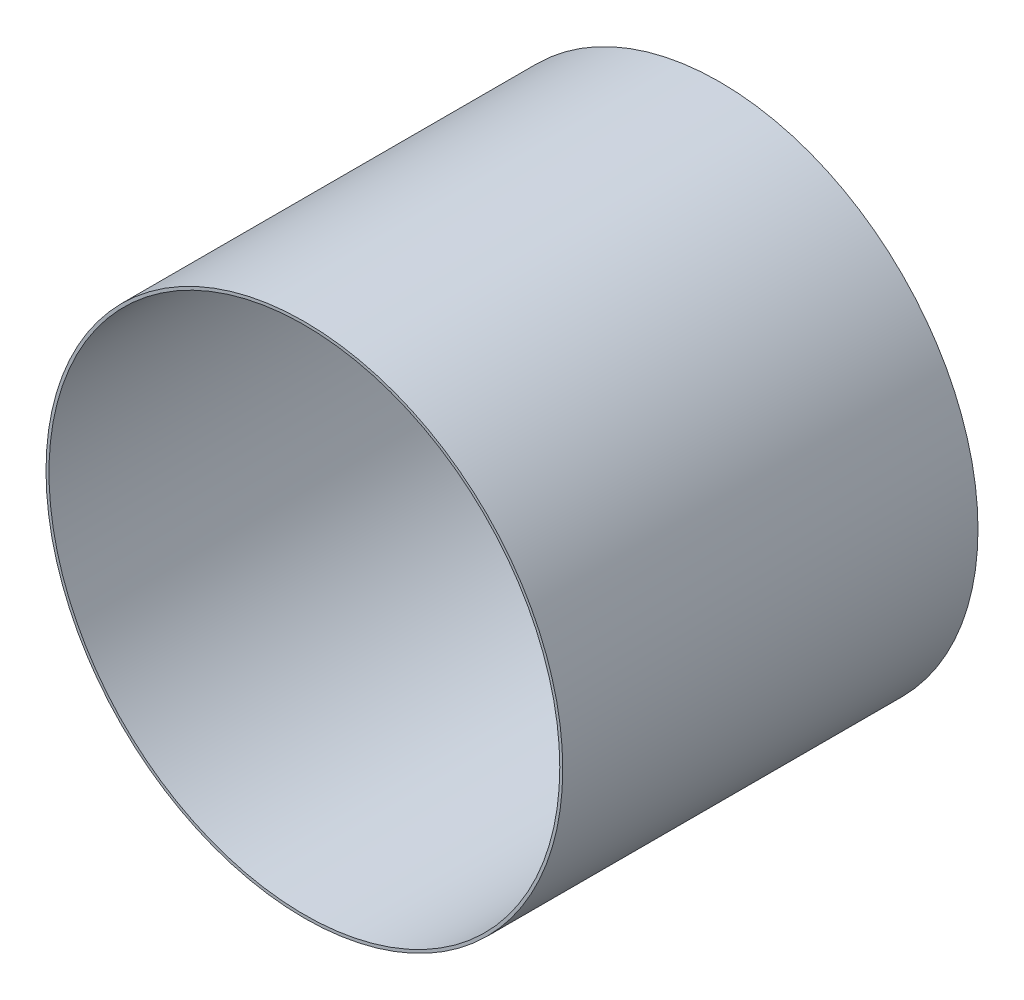
ISO-10303-21;
HEADER;
FILE_DESCRIPTION(('STEP AP214'),'2;1');
FILE_NAME('part.step','',(''),(''),'','','');
FILE_SCHEMA(('AUTOMOTIVE_DESIGN { 1 0 10303 214 1 1 1 1 }'));
ENDSEC;
DATA;
#1=APPLICATION_CONTEXT('core data for automotive mechanical design processes');
#2=APPLICATION_PROTOCOL_DEFINITION('international standard','automotive_design',2000,#1);
#3=PRODUCT_CONTEXT('',#1,'mechanical');
#4=PRODUCT('Part','Part','',(#3));
#5=PRODUCT_RELATED_PRODUCT_CATEGORY('part','',(#4));
#6=PRODUCT_DEFINITION_FORMATION('','',#4);
#7=PRODUCT_DEFINITION_CONTEXT('part definition',#1,'design');
#8=PRODUCT_DEFINITION('design','',#6,#7);
#9=PRODUCT_DEFINITION_SHAPE('','',#8);
#10=(LENGTH_UNIT() NAMED_UNIT(*) SI_UNIT(.MILLI.,.METRE.));
#11=(NAMED_UNIT(*) PLANE_ANGLE_UNIT() SI_UNIT($,.RADIAN.));
#12=(NAMED_UNIT(*) SI_UNIT($,.STERADIAN.) SOLID_ANGLE_UNIT());
#13=UNCERTAINTY_MEASURE_WITH_UNIT(LENGTH_MEASURE(1.E-05),#10,'distance_accuracy_value','');
#14=(GEOMETRIC_REPRESENTATION_CONTEXT(3) GLOBAL_UNCERTAINTY_ASSIGNED_CONTEXT((#13)) GLOBAL_UNIT_ASSIGNED_CONTEXT((#10,
#11,#12)) REPRESENTATION_CONTEXT('',''));
#15=CARTESIAN_POINT('',(0.,0.,0.));
#16=DIRECTION('',(0.,0.,1.));
#17=DIRECTION('',(1.,0.,0.));
#18=AXIS2_PLACEMENT_3D('',#15,#16,#17);
#19=CARTESIAN_POINT('',(0.,0.,140.));
#20=DIRECTION('',(0.,0.,1.));
#21=DIRECTION('',(1.,0.,0.));
#22=AXIS2_PLACEMENT_3D('',#19,#20,#21);
#23=PLANE('',#22);
#24=CARTESIAN_POINT('',(0.,0.,140.));
#25=DIRECTION('',(0.,0.,1.));
#26=DIRECTION('',(1.,0.,0.));
#27=AXIS2_PLACEMENT_3D('',#24,#25,#26);
#28=CIRCLE('',#27,87.110994186458);
#29=CARTESIAN_POINT('',(87.110994186458,0.,140.));
#30=VERTEX_POINT('',#29);
#31=EDGE_CURVE('E10',#30,#30,#28,.T.);
#32=ORIENTED_EDGE('',*,*,#31,.T.);
#33=EDGE_LOOP('',(#32));
#34=FACE_BOUND('',#33,.T.);
#35=CARTESIAN_POINT('',(0.,0.,140.));
#36=DIRECTION('',(0.,0.,1.));
#37=DIRECTION('',(1.,0.,0.));
#38=AXIS2_PLACEMENT_3D('',#35,#36,#37);
#39=CIRCLE('',#38,86.110994186458);
#40=CARTESIAN_POINT('',(86.110994186458,0.,140.));
#41=VERTEX_POINT('',#40);
#42=EDGE_CURVE('E41',#41,#41,#39,.T.);
#43=ORIENTED_EDGE('',*,*,#42,.F.);
#44=EDGE_LOOP('',(#43));
#45=FACE_BOUND('',#44,.T.);
#46=ADVANCED_FACE('F30',(#34,#45),#23,.T.);
#47=CARTESIAN_POINT('',(0.,0.,0.));
#48=DIRECTION('',(0.,0.,1.));
#49=DIRECTION('',(1.,0.,0.));
#50=AXIS2_PLACEMENT_3D('',#47,#48,#49);
#51=PLANE('',#50);
#52=CARTESIAN_POINT('',(0.,0.,0.));
#53=DIRECTION('',(0.,0.,1.));
#54=DIRECTION('',(1.,0.,0.));
#55=AXIS2_PLACEMENT_3D('',#52,#53,#54);
#56=CIRCLE('',#55,87.110994186458);
#57=CARTESIAN_POINT('',(87.110994186458,0.,0.));
#58=VERTEX_POINT('',#57);
#59=EDGE_CURVE('E34',#58,#58,#56,.T.);
#60=ORIENTED_EDGE('',*,*,#59,.F.);
#61=EDGE_LOOP('',(#60));
#62=FACE_BOUND('',#61,.T.);
#63=CARTESIAN_POINT('',(0.,0.,0.));
#64=DIRECTION('',(0.,0.,1.));
#65=DIRECTION('',(1.,0.,0.));
#66=AXIS2_PLACEMENT_3D('',#63,#64,#65);
#67=CIRCLE('',#66,86.110994186458);
#68=CARTESIAN_POINT('',(86.110994186458,0.,0.));
#69=VERTEX_POINT('',#68);
#70=EDGE_CURVE('E43',#69,#69,#67,.T.);
#71=ORIENTED_EDGE('',*,*,#70,.T.);
#72=EDGE_LOOP('',(#71));
#73=FACE_BOUND('',#72,.T.);
#74=ADVANCED_FACE('F53',(#62,#73),#51,.F.);
#75=CARTESIAN_POINT('',(0.,0.,140.));
#76=DIRECTION('',(0.,0.,-1.));
#77=DIRECTION('',(-1.,0.,0.));
#78=AXIS2_PLACEMENT_3D('',#75,#76,#77);
#79=CYLINDRICAL_SURFACE('',#78,87.110994186458);
#80=ORIENTED_EDGE('',*,*,#31,.F.);
#81=EDGE_LOOP('',(#80));
#82=FACE_BOUND('',#81,.T.);
#83=ORIENTED_EDGE('',*,*,#59,.T.);
#84=EDGE_LOOP('',(#83));
#85=FACE_BOUND('',#84,.T.);
#86=ADVANCED_FACE('F32',(#82,#85),#79,.T.);
#87=CARTESIAN_POINT('',(0.,0.,140.));
#88=DIRECTION('',(0.,0.,-1.));
#89=DIRECTION('',(-1.,0.,0.));
#90=AXIS2_PLACEMENT_3D('',#87,#88,#89);
#91=CYLINDRICAL_SURFACE('',#90,86.110994186458);
#92=ORIENTED_EDGE('',*,*,#42,.T.);
#93=EDGE_LOOP('',(#92));
#94=FACE_BOUND('',#93,.T.);
#95=ORIENTED_EDGE('',*,*,#70,.F.);
#96=EDGE_LOOP('',(#95));
#97=FACE_BOUND('',#96,.T.);
#98=ADVANCED_FACE('F49',(#94,#97),#91,.F.);
#99=CLOSED_SHELL('',(#46,#74,#86,#98));
#100=MANIFOLD_SOLID_BREP('B2',#99);
#101=ADVANCED_BREP_SHAPE_REPRESENTATION('',(#18,#100),#14);
#102=SHAPE_DEFINITION_REPRESENTATION(#9,#101);
ENDSEC;
END-ISO-10303-21;
